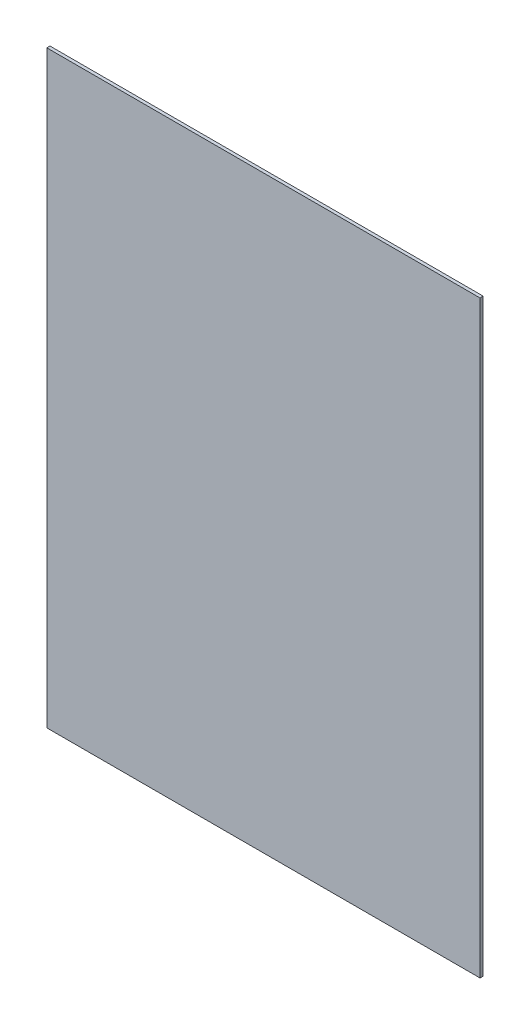
ISO-10303-21;
HEADER;
FILE_DESCRIPTION(('STEP AP214'),'2;1');
FILE_NAME('part.step','',(''),(''),'','','');
FILE_SCHEMA(('AUTOMOTIVE_DESIGN { 1 0 10303 214 1 1 1 1 }'));
ENDSEC;
DATA;
#1=APPLICATION_CONTEXT('core data for automotive mechanical design processes');
#2=APPLICATION_PROTOCOL_DEFINITION('international standard','automotive_design',2000,#1);
#3=PRODUCT_CONTEXT('',#1,'mechanical');
#4=PRODUCT('Part','Part','',(#3));
#5=PRODUCT_RELATED_PRODUCT_CATEGORY('part','',(#4));
#6=PRODUCT_DEFINITION_FORMATION('','',#4);
#7=PRODUCT_DEFINITION_CONTEXT('part definition',#1,'design');
#8=PRODUCT_DEFINITION('design','',#6,#7);
#9=PRODUCT_DEFINITION_SHAPE('','',#8);
#10=(LENGTH_UNIT() NAMED_UNIT(*) SI_UNIT(.MILLI.,.METRE.));
#11=(NAMED_UNIT(*) PLANE_ANGLE_UNIT() SI_UNIT($,.RADIAN.));
#12=(NAMED_UNIT(*) SI_UNIT($,.STERADIAN.) SOLID_ANGLE_UNIT());
#13=UNCERTAINTY_MEASURE_WITH_UNIT(LENGTH_MEASURE(1.E-05),#10,'distance_accuracy_value','');
#14=(GEOMETRIC_REPRESENTATION_CONTEXT(3) GLOBAL_UNCERTAINTY_ASSIGNED_CONTEXT((#13)) GLOBAL_UNIT_ASSIGNED_CONTEXT((#10,
#11,#12)) REPRESENTATION_CONTEXT('',''));
#15=CARTESIAN_POINT('',(0.,0.,0.));
#16=DIRECTION('',(0.,0.,1.));
#17=DIRECTION('',(1.,0.,0.));
#18=AXIS2_PLACEMENT_3D('',#15,#16,#17);
#19=CARTESIAN_POINT('',(0.,0.,5.));
#20=DIRECTION('',(1.,0.,0.));
#21=DIRECTION('',(0.,0.,-1.));
#22=AXIS2_PLACEMENT_3D('',#19,#20,#21);
#23=PLANE('',#22);
#24=DIRECTION('',(0.,-1.,0.));
#25=VECTOR('',#24,1.);
#26=CARTESIAN_POINT('',(0.,0.,0.));
#27=LINE('',#26,#25);
#28=CARTESIAN_POINT('',(0.,934.,0.));
#29=VERTEX_POINT('',#28);
#30=CARTESIAN_POINT('',(0.,0.,0.));
#31=VERTEX_POINT('',#30);
#32=EDGE_CURVE('E100',#29,#31,#27,.T.);
#33=ORIENTED_EDGE('',*,*,#32,.T.);
#34=DIRECTION('',(0.,0.,-1.));
#35=VECTOR('',#34,1.);
#36=CARTESIAN_POINT('',(0.,0.,5.));
#37=LINE('',#36,#35);
#38=CARTESIAN_POINT('',(0.,0.,5.));
#39=VERTEX_POINT('',#38);
#40=EDGE_CURVE('E11',#39,#31,#37,.T.);
#41=ORIENTED_EDGE('',*,*,#40,.F.);
#42=DIRECTION('',(0.,-1.,0.));
#43=VECTOR('',#42,1.);
#44=CARTESIAN_POINT('',(0.,0.,5.));
#45=LINE('',#44,#43);
#46=CARTESIAN_POINT('',(0.,934.,5.));
#47=VERTEX_POINT('',#46);
#48=EDGE_CURVE('E88',#47,#39,#45,.T.);
#49=ORIENTED_EDGE('',*,*,#48,.F.);
#50=DIRECTION('',(0.,0.,-1.));
#51=VECTOR('',#50,1.);
#52=CARTESIAN_POINT('',(0.,934.,5.));
#53=LINE('',#52,#51);
#54=EDGE_CURVE('E96',#47,#29,#53,.T.);
#55=ORIENTED_EDGE('',*,*,#54,.T.);
#56=EDGE_LOOP('',(#33,#41,#49,#55));
#57=FACE_BOUND('',#56,.T.);
#58=ADVANCED_FACE('F37',(#57),#23,.F.);
#59=CARTESIAN_POINT('',(0.,0.,5.));
#60=DIRECTION('',(0.,1.,0.));
#61=DIRECTION('',(0.,0.,1.));
#62=AXIS2_PLACEMENT_3D('',#59,#60,#61);
#63=PLANE('',#62);
#64=DIRECTION('',(1.,0.,0.));
#65=VECTOR('',#64,1.);
#66=CARTESIAN_POINT('',(0.,0.,0.));
#67=LINE('',#66,#65);
#68=CARTESIAN_POINT('',(687.,0.,0.));
#69=VERTEX_POINT('',#68);
#70=EDGE_CURVE('E92',#31,#69,#67,.T.);
#71=ORIENTED_EDGE('',*,*,#70,.T.);
#72=DIRECTION('',(0.,0.,-1.));
#73=VECTOR('',#72,1.);
#74=CARTESIAN_POINT('',(687.,0.,5.));
#75=LINE('',#74,#73);
#76=CARTESIAN_POINT('',(687.,0.,5.));
#77=VERTEX_POINT('',#76);
#78=EDGE_CURVE('E45',#77,#69,#75,.T.);
#79=ORIENTED_EDGE('',*,*,#78,.F.);
#80=DIRECTION('',(1.,0.,0.));
#81=VECTOR('',#80,1.);
#82=CARTESIAN_POINT('',(0.,0.,5.));
#83=LINE('',#82,#81);
#84=EDGE_CURVE('E83',#39,#77,#83,.T.);
#85=ORIENTED_EDGE('',*,*,#84,.F.);
#86=ORIENTED_EDGE('',*,*,#40,.T.);
#87=EDGE_LOOP('',(#71,#79,#85,#86));
#88=FACE_BOUND('',#87,.T.);
#89=ADVANCED_FACE('F91',(#88),#63,.F.);
#90=CARTESIAN_POINT('',(687.,0.,5.));
#91=DIRECTION('',(-1.,0.,0.));
#92=DIRECTION('',(0.,0.,1.));
#93=AXIS2_PLACEMENT_3D('',#90,#91,#92);
#94=PLANE('',#93);
#95=DIRECTION('',(0.,1.,0.));
#96=VECTOR('',#95,1.);
#97=CARTESIAN_POINT('',(687.,0.,0.));
#98=LINE('',#97,#96);
#99=CARTESIAN_POINT('',(687.,934.,0.));
#100=VERTEX_POINT('',#99);
#101=EDGE_CURVE('E70',#69,#100,#98,.T.);
#102=ORIENTED_EDGE('',*,*,#101,.T.);
#103=DIRECTION('',(0.,0.,-1.));
#104=VECTOR('',#103,1.);
#105=CARTESIAN_POINT('',(687.,934.,5.));
#106=LINE('',#105,#104);
#107=CARTESIAN_POINT('',(687.,934.,5.));
#108=VERTEX_POINT('',#107);
#109=EDGE_CURVE('E93',#108,#100,#106,.T.);
#110=ORIENTED_EDGE('',*,*,#109,.F.);
#111=DIRECTION('',(0.,1.,0.));
#112=VECTOR('',#111,1.);
#113=CARTESIAN_POINT('',(687.,0.,5.));
#114=LINE('',#113,#112);
#115=EDGE_CURVE('E86',#77,#108,#114,.T.);
#116=ORIENTED_EDGE('',*,*,#115,.F.);
#117=ORIENTED_EDGE('',*,*,#78,.T.);
#118=EDGE_LOOP('',(#102,#110,#116,#117));
#119=FACE_BOUND('',#118,.T.);
#120=ADVANCED_FACE('F94',(#119),#94,.F.);
#121=CARTESIAN_POINT('',(0.,934.,5.));
#122=DIRECTION('',(0.,-1.,0.));
#123=DIRECTION('',(0.,0.,-1.));
#124=AXIS2_PLACEMENT_3D('',#121,#122,#123);
#125=PLANE('',#124);
#126=DIRECTION('',(-1.,0.,0.));
#127=VECTOR('',#126,1.);
#128=CARTESIAN_POINT('',(0.,934.,0.));
#129=LINE('',#128,#127);
#130=EDGE_CURVE('E76',#100,#29,#129,.T.);
#131=ORIENTED_EDGE('',*,*,#130,.T.);
#132=ORIENTED_EDGE('',*,*,#54,.F.);
#133=DIRECTION('',(-1.,0.,0.));
#134=VECTOR('',#133,1.);
#135=CARTESIAN_POINT('',(0.,934.,5.));
#136=LINE('',#135,#134);
#137=EDGE_CURVE('E53',#108,#47,#136,.T.);
#138=ORIENTED_EDGE('',*,*,#137,.F.);
#139=ORIENTED_EDGE('',*,*,#109,.T.);
#140=EDGE_LOOP('',(#131,#132,#138,#139));
#141=FACE_BOUND('',#140,.T.);
#142=ADVANCED_FACE('F107',(#141),#125,.F.);
#143=CARTESIAN_POINT('',(0.,0.,5.));
#144=DIRECTION('',(0.,0.,-1.));
#145=DIRECTION('',(-1.,0.,0.));
#146=AXIS2_PLACEMENT_3D('',#143,#144,#145);
#147=PLANE('',#146);
#148=ORIENTED_EDGE('',*,*,#48,.T.);
#149=ORIENTED_EDGE('',*,*,#84,.T.);
#150=ORIENTED_EDGE('',*,*,#115,.T.);
#151=ORIENTED_EDGE('',*,*,#137,.T.);
#152=EDGE_LOOP('',(#148,#149,#150,#151));
#153=FACE_BOUND('',#152,.T.);
#154=ADVANCED_FACE('F84',(#153),#147,.F.);
#155=CARTESIAN_POINT('',(0.,0.,0.));
#156=DIRECTION('',(0.,0.,-1.));
#157=DIRECTION('',(-1.,0.,0.));
#158=AXIS2_PLACEMENT_3D('',#155,#156,#157);
#159=PLANE('',#158);
#160=ORIENTED_EDGE('',*,*,#32,.F.);
#161=ORIENTED_EDGE('',*,*,#130,.F.);
#162=ORIENTED_EDGE('',*,*,#101,.F.);
#163=ORIENTED_EDGE('',*,*,#70,.F.);
#164=EDGE_LOOP('',(#160,#161,#162,#163));
#165=FACE_BOUND('',#164,.T.);
#166=ADVANCED_FACE('F110',(#165),#159,.T.);
#167=CLOSED_SHELL('',(#58,#89,#120,#142,#154,#166));
#168=MANIFOLD_SOLID_BREP('B2',#167);
#169=ADVANCED_BREP_SHAPE_REPRESENTATION('',(#18,#168),#14);
#170=SHAPE_DEFINITION_REPRESENTATION(#9,#169);
ENDSEC;
END-ISO-10303-21;
